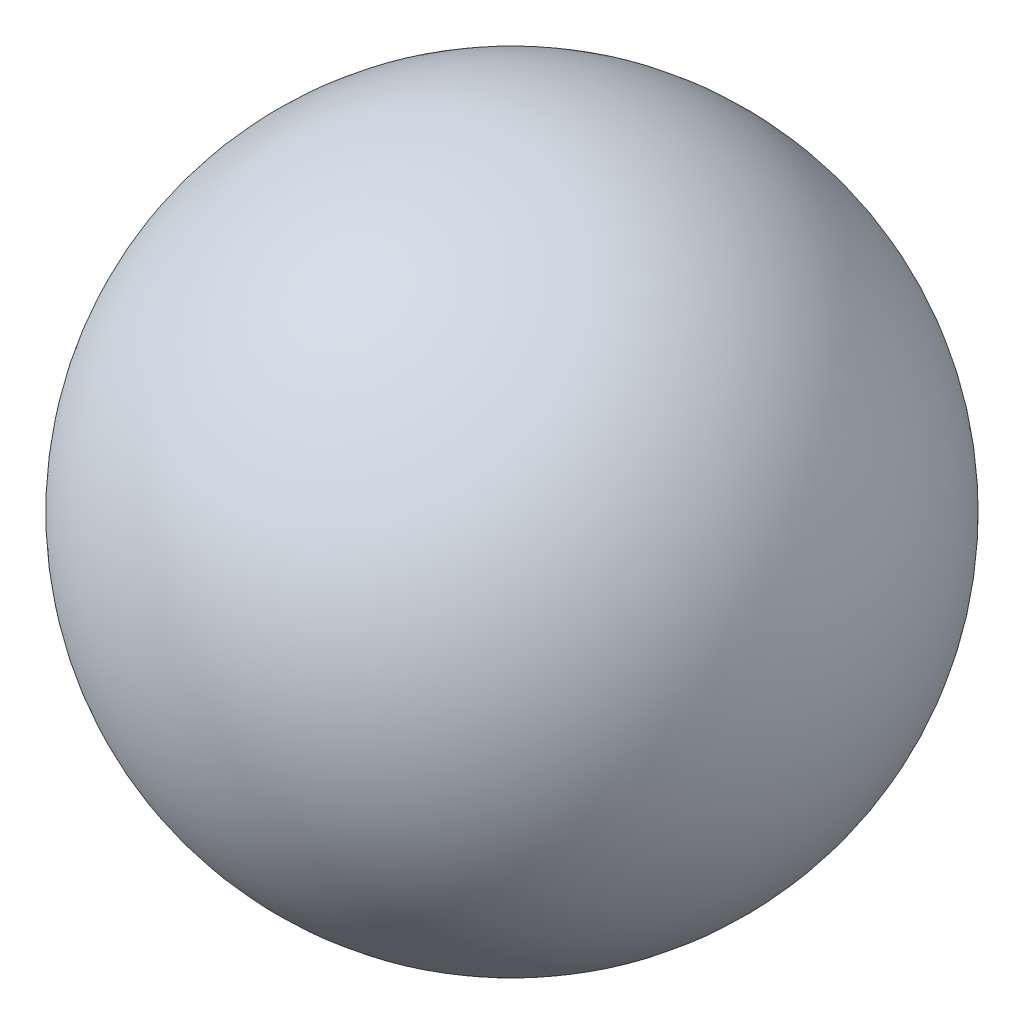
ISO-10303-21;
HEADER;
FILE_DESCRIPTION(('STEP AP214'),'2;1');
FILE_NAME('part.step','',(''),(''),'','','');
FILE_SCHEMA(('AUTOMOTIVE_DESIGN { 1 0 10303 214 1 1 1 1 }'));
ENDSEC;
DATA;
#1=APPLICATION_CONTEXT('core data for automotive mechanical design processes');
#2=APPLICATION_PROTOCOL_DEFINITION('international standard','automotive_design',2000,#1);
#3=PRODUCT_CONTEXT('',#1,'mechanical');
#4=PRODUCT('Part','Part','',(#3));
#5=PRODUCT_RELATED_PRODUCT_CATEGORY('part','',(#4));
#6=PRODUCT_DEFINITION_FORMATION('','',#4);
#7=PRODUCT_DEFINITION_CONTEXT('part definition',#1,'design');
#8=PRODUCT_DEFINITION('design','',#6,#7);
#9=PRODUCT_DEFINITION_SHAPE('','',#8);
#10=(LENGTH_UNIT() NAMED_UNIT(*) SI_UNIT(.MILLI.,.METRE.));
#11=(NAMED_UNIT(*) PLANE_ANGLE_UNIT() SI_UNIT($,.RADIAN.));
#12=(NAMED_UNIT(*) SI_UNIT($,.STERADIAN.) SOLID_ANGLE_UNIT());
#13=UNCERTAINTY_MEASURE_WITH_UNIT(LENGTH_MEASURE(1.E-05),#10,'distance_accuracy_value','');
#14=(GEOMETRIC_REPRESENTATION_CONTEXT(3) GLOBAL_UNCERTAINTY_ASSIGNED_CONTEXT((#13)) GLOBAL_UNIT_ASSIGNED_CONTEXT((#10,
#11,#12)) REPRESENTATION_CONTEXT('',''));
#15=CARTESIAN_POINT('',(0.,0.,0.));
#16=DIRECTION('',(0.,0.,1.));
#17=DIRECTION('',(1.,0.,0.));
#18=AXIS2_PLACEMENT_3D('',#15,#16,#17);
#19=CARTESIAN_POINT('',(-1.11022302462516E-13,6.75000000000017,0.));
#20=DIRECTION('',(0.,-1.,0.));
#21=DIRECTION('',(1.,0.,0.));
#22=AXIS2_PLACEMENT_3D('',#19,#20,#21);
#23=SPHERICAL_SURFACE('',#22,1.5);
#24=CARTESIAN_POINT('',(-1.11022302462516E-13,5.25000000000017,0.));
#25=VERTEX_POINT('',#24);
#26=VERTEX_LOOP('',#25);
#27=FACE_BOUND('',#26,.T.);
#28=ADVANCED_FACE('F22',(#27),#23,.T.);
#29=CLOSED_SHELL('',(#28));
#30=MANIFOLD_SOLID_BREP('B2',#29);
#31=ADVANCED_BREP_SHAPE_REPRESENTATION('',(#18,#30),#14);
#32=SHAPE_DEFINITION_REPRESENTATION(#9,#31);
ENDSEC;
END-ISO-10303-21;
